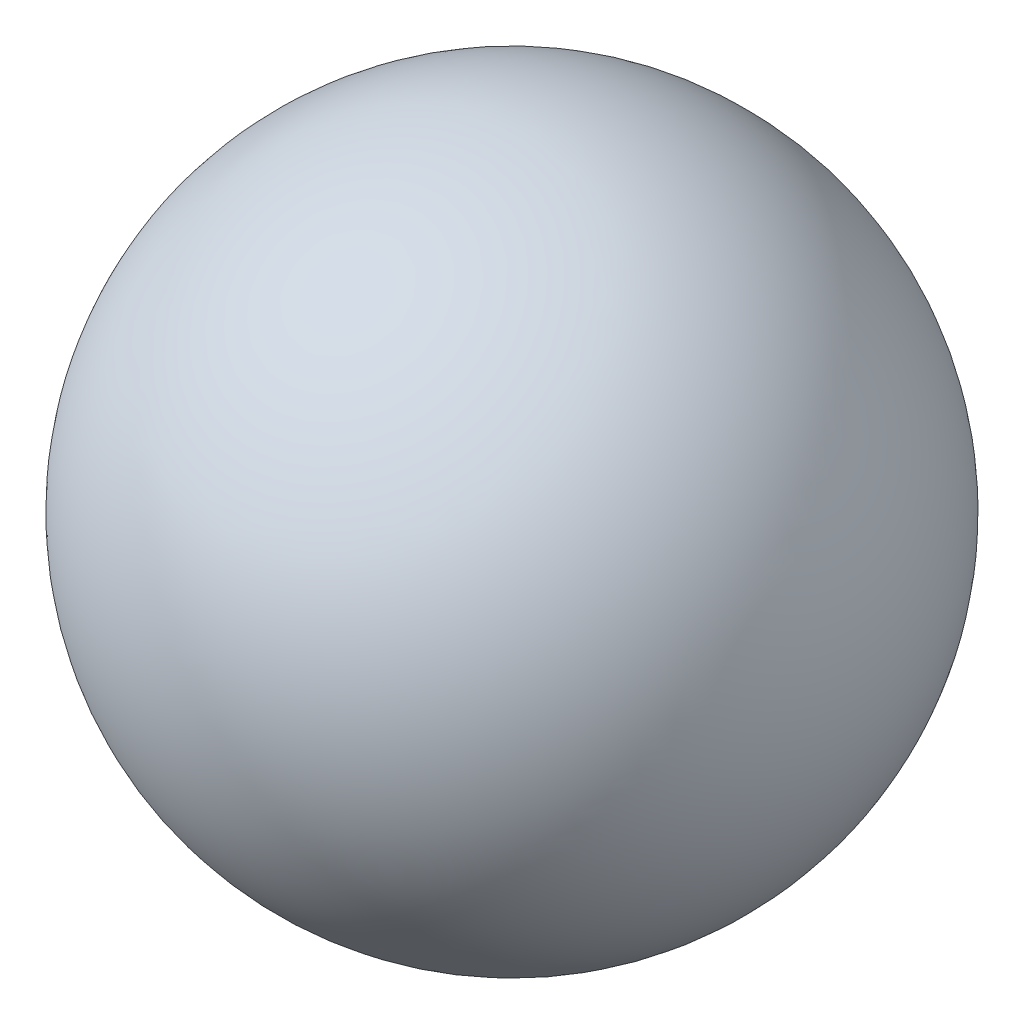
ISO-10303-21;
HEADER;
FILE_DESCRIPTION(('STEP AP214'),'2;1');
FILE_NAME('part.step','',(''),(''),'','','');
FILE_SCHEMA(('AUTOMOTIVE_DESIGN { 1 0 10303 214 1 1 1 1 }'));
ENDSEC;
DATA;
#1=APPLICATION_CONTEXT('core data for automotive mechanical design processes');
#2=APPLICATION_PROTOCOL_DEFINITION('international standard','automotive_design',2000,#1);
#3=PRODUCT_CONTEXT('',#1,'mechanical');
#4=PRODUCT('Part','Part','',(#3));
#5=PRODUCT_RELATED_PRODUCT_CATEGORY('part','',(#4));
#6=PRODUCT_DEFINITION_FORMATION('','',#4);
#7=PRODUCT_DEFINITION_CONTEXT('part definition',#1,'design');
#8=PRODUCT_DEFINITION('design','',#6,#7);
#9=PRODUCT_DEFINITION_SHAPE('','',#8);
#10=(LENGTH_UNIT() NAMED_UNIT(*) SI_UNIT(.MILLI.,.METRE.));
#11=(NAMED_UNIT(*) PLANE_ANGLE_UNIT() SI_UNIT($,.RADIAN.));
#12=(NAMED_UNIT(*) SI_UNIT($,.STERADIAN.) SOLID_ANGLE_UNIT());
#13=UNCERTAINTY_MEASURE_WITH_UNIT(LENGTH_MEASURE(1.E-05),#10,'distance_accuracy_value','');
#14=(GEOMETRIC_REPRESENTATION_CONTEXT(3) GLOBAL_UNCERTAINTY_ASSIGNED_CONTEXT((#13)) GLOBAL_UNIT_ASSIGNED_CONTEXT((#10,
#11,#12)) REPRESENTATION_CONTEXT('',''));
#15=CARTESIAN_POINT('',(0.,0.,0.));
#16=DIRECTION('',(0.,0.,1.));
#17=DIRECTION('',(1.,0.,0.));
#18=AXIS2_PLACEMENT_3D('',#15,#16,#17);
#19=CARTESIAN_POINT('',(0.,0.,0.));
#20=DIRECTION('',(-1.,0.,0.));
#21=DIRECTION('',(0.,1.,0.));
#22=AXIS2_PLACEMENT_3D('',#19,#20,#21);
#23=SPHERICAL_SURFACE('',#22,44.45);
#24=CARTESIAN_POINT('',(-44.45,0.,0.));
#25=VERTEX_POINT('',#24);
#26=VERTEX_LOOP('',#25);
#27=FACE_BOUND('',#26,.T.);
#28=ADVANCED_FACE('F35',(#27),#23,.T.);
#29=CLOSED_SHELL('',(#28));
#30=MANIFOLD_SOLID_BREP('B2',#29);
#31=ADVANCED_BREP_SHAPE_REPRESENTATION('',(#18,#30),#14);
#32=SHAPE_DEFINITION_REPRESENTATION(#9,#31);
ENDSEC;
END-ISO-10303-21;
